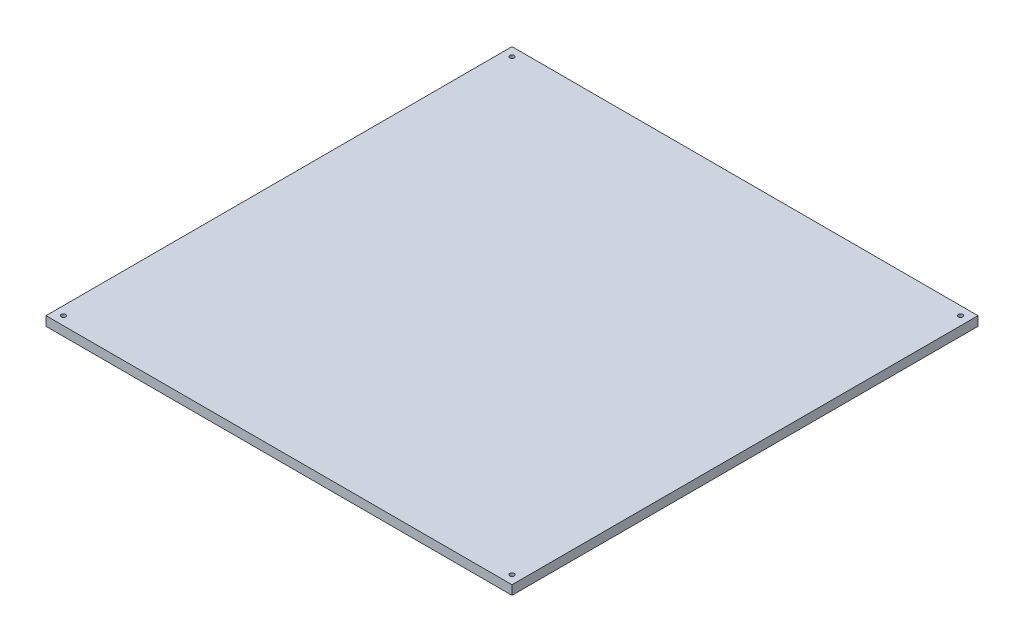
ISO-10303-21;
HEADER;
FILE_DESCRIPTION(('STEP AP214'),'2;1');
FILE_NAME('part.step','',(''),(''),'','','');
FILE_SCHEMA(('AUTOMOTIVE_DESIGN { 1 0 10303 214 1 1 1 1 }'));
ENDSEC;
DATA;
#1=APPLICATION_CONTEXT('core data for automotive mechanical design processes');
#2=APPLICATION_PROTOCOL_DEFINITION('international standard','automotive_design',2000,#1);
#3=PRODUCT_CONTEXT('',#1,'mechanical');
#4=PRODUCT('Part','Part','',(#3));
#5=PRODUCT_RELATED_PRODUCT_CATEGORY('part','',(#4));
#6=PRODUCT_DEFINITION_FORMATION('','',#4);
#7=PRODUCT_DEFINITION_CONTEXT('part definition',#1,'design');
#8=PRODUCT_DEFINITION('design','',#6,#7);
#9=PRODUCT_DEFINITION_SHAPE('','',#8);
#10=(LENGTH_UNIT() NAMED_UNIT(*) SI_UNIT(.MILLI.,.METRE.));
#11=(NAMED_UNIT(*) PLANE_ANGLE_UNIT() SI_UNIT($,.RADIAN.));
#12=(NAMED_UNIT(*) SI_UNIT($,.STERADIAN.) SOLID_ANGLE_UNIT());
#13=UNCERTAINTY_MEASURE_WITH_UNIT(LENGTH_MEASURE(1.E-05),#10,'distance_accuracy_value','');
#14=(GEOMETRIC_REPRESENTATION_CONTEXT(3) GLOBAL_UNCERTAINTY_ASSIGNED_CONTEXT((#13)) GLOBAL_UNIT_ASSIGNED_CONTEXT((#10,
#11,#12)) REPRESENTATION_CONTEXT('',''));
#15=CARTESIAN_POINT('',(0.,0.,0.));
#16=DIRECTION('',(0.,0.,1.));
#17=DIRECTION('',(1.,0.,0.));
#18=AXIS2_PLACEMENT_3D('',#15,#16,#17);
#19=CARTESIAN_POINT('',(-160.,-6.35,160.));
#20=DIRECTION('',(0.,0.,1.));
#21=DIRECTION('',(1.,0.,0.));
#22=AXIS2_PLACEMENT_3D('',#19,#20,#21);
#23=PLANE('',#22);
#24=DIRECTION('',(1.,0.,0.));
#25=VECTOR('',#24,1.);
#26=CARTESIAN_POINT('',(-160.,0.,160.));
#27=LINE('',#26,#25);
#28=CARTESIAN_POINT('',(-160.,0.,160.));
#29=VERTEX_POINT('',#28);
#30=CARTESIAN_POINT('',(160.,0.,160.));
#31=VERTEX_POINT('',#30);
#32=EDGE_CURVE('E105',#29,#31,#27,.T.);
#33=ORIENTED_EDGE('',*,*,#32,.F.);
#34=DIRECTION('',(0.,1.,0.));
#35=VECTOR('',#34,1.);
#36=CARTESIAN_POINT('',(-160.,-6.35,160.));
#37=LINE('',#36,#35);
#38=CARTESIAN_POINT('',(-160.,-6.35,160.));
#39=VERTEX_POINT('',#38);
#40=EDGE_CURVE('E11',#39,#29,#37,.T.);
#41=ORIENTED_EDGE('',*,*,#40,.F.);
#42=DIRECTION('',(1.,0.,0.));
#43=VECTOR('',#42,1.);
#44=CARTESIAN_POINT('',(-160.,-6.35,160.));
#45=LINE('',#44,#43);
#46=CARTESIAN_POINT('',(160.,-6.35,160.));
#47=VERTEX_POINT('',#46);
#48=EDGE_CURVE('E96',#39,#47,#45,.T.);
#49=ORIENTED_EDGE('',*,*,#48,.T.);
#50=DIRECTION('',(0.,1.,0.));
#51=VECTOR('',#50,1.);
#52=CARTESIAN_POINT('',(160.,-6.35,160.));
#53=LINE('',#52,#51);
#54=EDGE_CURVE('E40',#47,#31,#53,.T.);
#55=ORIENTED_EDGE('',*,*,#54,.T.);
#56=EDGE_LOOP('',(#33,#41,#49,#55));
#57=FACE_BOUND('',#56,.T.);
#58=ADVANCED_FACE('F37',(#57),#23,.T.);
#59=CARTESIAN_POINT('',(-160.,-6.35,-160.));
#60=DIRECTION('',(-1.,0.,0.));
#61=DIRECTION('',(0.,0.,1.));
#62=AXIS2_PLACEMENT_3D('',#59,#60,#61);
#63=PLANE('',#62);
#64=DIRECTION('',(0.,0.,1.));
#65=VECTOR('',#64,1.);
#66=CARTESIAN_POINT('',(-160.,0.,-160.));
#67=LINE('',#66,#65);
#68=CARTESIAN_POINT('',(-160.,0.,-160.));
#69=VERTEX_POINT('',#68);
#70=EDGE_CURVE('E100',#69,#29,#67,.T.);
#71=ORIENTED_EDGE('',*,*,#70,.F.);
#72=DIRECTION('',(0.,1.,0.));
#73=VECTOR('',#72,1.);
#74=CARTESIAN_POINT('',(-160.,-6.35,-160.));
#75=LINE('',#74,#73);
#76=CARTESIAN_POINT('',(-160.,-6.35,-160.));
#77=VERTEX_POINT('',#76);
#78=EDGE_CURVE('E46',#77,#69,#75,.T.);
#79=ORIENTED_EDGE('',*,*,#78,.F.);
#80=DIRECTION('',(0.,0.,1.));
#81=VECTOR('',#80,1.);
#82=CARTESIAN_POINT('',(-160.,-6.35,-160.));
#83=LINE('',#82,#81);
#84=EDGE_CURVE('E92',#77,#39,#83,.T.);
#85=ORIENTED_EDGE('',*,*,#84,.T.);
#86=ORIENTED_EDGE('',*,*,#40,.T.);
#87=EDGE_LOOP('',(#71,#79,#85,#86));
#88=FACE_BOUND('',#87,.T.);
#89=ADVANCED_FACE('F117',(#88),#63,.T.);
#90=CARTESIAN_POINT('',(160.,-6.35,-160.));
#91=DIRECTION('',(0.,0.,-1.));
#92=DIRECTION('',(-1.,0.,0.));
#93=AXIS2_PLACEMENT_3D('',#90,#91,#92);
#94=PLANE('',#93);
#95=DIRECTION('',(-1.,0.,0.));
#96=VECTOR('',#95,1.);
#97=CARTESIAN_POINT('',(160.,0.,-160.));
#98=LINE('',#97,#96);
#99=CARTESIAN_POINT('',(160.,0.,-160.));
#100=VERTEX_POINT('',#99);
#101=EDGE_CURVE('E87',#100,#69,#98,.T.);
#102=ORIENTED_EDGE('',*,*,#101,.F.);
#103=DIRECTION('',(0.,1.,0.));
#104=VECTOR('',#103,1.);
#105=CARTESIAN_POINT('',(160.,-6.35,-160.));
#106=LINE('',#105,#104);
#107=CARTESIAN_POINT('',(160.,-6.35,-160.));
#108=VERTEX_POINT('',#107);
#109=EDGE_CURVE('E82',#108,#100,#106,.T.);
#110=ORIENTED_EDGE('',*,*,#109,.F.);
#111=DIRECTION('',(-1.,0.,0.));
#112=VECTOR('',#111,1.);
#113=CARTESIAN_POINT('',(160.,-6.35,-160.));
#114=LINE('',#113,#112);
#115=EDGE_CURVE('E85',#108,#77,#114,.T.);
#116=ORIENTED_EDGE('',*,*,#115,.T.);
#117=ORIENTED_EDGE('',*,*,#78,.T.);
#118=EDGE_LOOP('',(#102,#110,#116,#117));
#119=FACE_BOUND('',#118,.T.);
#120=ADVANCED_FACE('F84',(#119),#94,.T.);
#121=CARTESIAN_POINT('',(160.,-6.35,160.));
#122=DIRECTION('',(1.,0.,0.));
#123=DIRECTION('',(0.,0.,-1.));
#124=AXIS2_PLACEMENT_3D('',#121,#122,#123);
#125=PLANE('',#124);
#126=DIRECTION('',(0.,0.,-1.));
#127=VECTOR('',#126,1.);
#128=CARTESIAN_POINT('',(160.,0.,160.));
#129=LINE('',#128,#127);
#130=EDGE_CURVE('E108',#31,#100,#129,.T.);
#131=ORIENTED_EDGE('',*,*,#130,.F.);
#132=ORIENTED_EDGE('',*,*,#54,.F.);
#133=DIRECTION('',(0.,0.,-1.));
#134=VECTOR('',#133,1.);
#135=CARTESIAN_POINT('',(160.,-6.35,160.));
#136=LINE('',#135,#134);
#137=EDGE_CURVE('E91',#47,#108,#136,.T.);
#138=ORIENTED_EDGE('',*,*,#137,.T.);
#139=ORIENTED_EDGE('',*,*,#109,.T.);
#140=EDGE_LOOP('',(#131,#132,#138,#139));
#141=FACE_BOUND('',#140,.T.);
#142=ADVANCED_FACE('F94',(#141),#125,.T.);
#143=CARTESIAN_POINT('',(0.,-6.35,0.));
#144=DIRECTION('',(0.,1.,0.));
#145=DIRECTION('',(0.,0.,1.));
#146=AXIS2_PLACEMENT_3D('',#143,#144,#145);
#147=PLANE('',#146);
#148=CARTESIAN_POINT('',(-154.,-6.35,-154.));
#149=DIRECTION('',(0.,1.,0.));
#150=DIRECTION('',(0.,0.,-1.));
#151=AXIS2_PLACEMENT_3D('',#148,#149,#150);
#152=CIRCLE('',#151,1.54999999999999);
#153=CARTESIAN_POINT('',(-154.,-6.35,-155.55));
#154=VERTEX_POINT('',#153);
#155=EDGE_CURVE('E157',#154,#154,#152,.T.);
#156=ORIENTED_EDGE('',*,*,#155,.T.);
#157=EDGE_LOOP('',(#156));
#158=FACE_BOUND('',#157,.T.);
#159=CARTESIAN_POINT('',(154.,-6.35,154.));
#160=DIRECTION('',(0.,1.,0.));
#161=DIRECTION('',(0.,0.,-1.));
#162=AXIS2_PLACEMENT_3D('',#159,#160,#161);
#163=CIRCLE('',#162,1.54999999999999);
#164=CARTESIAN_POINT('',(154.,-6.35,152.45));
#165=VERTEX_POINT('',#164);
#166=EDGE_CURVE('E165',#165,#165,#163,.T.);
#167=ORIENTED_EDGE('',*,*,#166,.T.);
#168=EDGE_LOOP('',(#167));
#169=FACE_BOUND('',#168,.T.);
#170=CARTESIAN_POINT('',(-154.,-6.35,154.));
#171=DIRECTION('',(0.,1.,0.));
#172=DIRECTION('',(0.,0.,-1.));
#173=AXIS2_PLACEMENT_3D('',#170,#171,#172);
#174=CIRCLE('',#173,1.54999999999999);
#175=CARTESIAN_POINT('',(-154.,-6.35,152.45));
#176=VERTEX_POINT('',#175);
#177=EDGE_CURVE('E171',#176,#176,#174,.T.);
#178=ORIENTED_EDGE('',*,*,#177,.T.);
#179=EDGE_LOOP('',(#178));
#180=FACE_BOUND('',#179,.T.);
#181=CARTESIAN_POINT('',(154.,-6.35,-154.));
#182=DIRECTION('',(0.,1.,0.));
#183=DIRECTION('',(0.,0.,-1.));
#184=AXIS2_PLACEMENT_3D('',#181,#182,#183);
#185=CIRCLE('',#184,1.54999999999999);
#186=CARTESIAN_POINT('',(154.,-6.35,-155.55));
#187=VERTEX_POINT('',#186);
#188=EDGE_CURVE('E109',#187,#187,#185,.T.);
#189=ORIENTED_EDGE('',*,*,#188,.T.);
#190=EDGE_LOOP('',(#189));
#191=FACE_BOUND('',#190,.T.);
#192=ORIENTED_EDGE('',*,*,#48,.F.);
#193=ORIENTED_EDGE('',*,*,#84,.F.);
#194=ORIENTED_EDGE('',*,*,#115,.F.);
#195=ORIENTED_EDGE('',*,*,#137,.F.);
#196=EDGE_LOOP('',(#192,#193,#194,#195));
#197=FACE_BOUND('',#196,.T.);
#198=ADVANCED_FACE('F90',(#158,#169,#180,#191,#197),#147,.F.);
#199=CARTESIAN_POINT('',(0.,0.,0.));
#200=DIRECTION('',(0.,1.,0.));
#201=DIRECTION('',(0.,0.,1.));
#202=AXIS2_PLACEMENT_3D('',#199,#200,#201);
#203=PLANE('',#202);
#204=CARTESIAN_POINT('',(-154.,0.,-154.));
#205=DIRECTION('',(0.,1.,0.));
#206=DIRECTION('',(0.,0.,-1.));
#207=AXIS2_PLACEMENT_3D('',#204,#205,#206);
#208=CIRCLE('',#207,1.54999999999999);
#209=CARTESIAN_POINT('',(-154.,0.,-155.55));
#210=VERTEX_POINT('',#209);
#211=EDGE_CURVE('E160',#210,#210,#208,.T.);
#212=ORIENTED_EDGE('',*,*,#211,.F.);
#213=EDGE_LOOP('',(#212));
#214=FACE_BOUND('',#213,.T.);
#215=CARTESIAN_POINT('',(154.,0.,154.));
#216=DIRECTION('',(0.,1.,0.));
#217=DIRECTION('',(0.,0.,-1.));
#218=AXIS2_PLACEMENT_3D('',#215,#216,#217);
#219=CIRCLE('',#218,1.54999999999999);
#220=CARTESIAN_POINT('',(154.,0.,152.45));
#221=VERTEX_POINT('',#220);
#222=EDGE_CURVE('E162',#221,#221,#219,.T.);
#223=ORIENTED_EDGE('',*,*,#222,.F.);
#224=EDGE_LOOP('',(#223));
#225=FACE_BOUND('',#224,.T.);
#226=CARTESIAN_POINT('',(-154.,0.,154.));
#227=DIRECTION('',(0.,1.,0.));
#228=DIRECTION('',(0.,0.,-1.));
#229=AXIS2_PLACEMENT_3D('',#226,#227,#228);
#230=CIRCLE('',#229,1.54999999999999);
#231=CARTESIAN_POINT('',(-154.,0.,152.45));
#232=VERTEX_POINT('',#231);
#233=EDGE_CURVE('E168',#232,#232,#230,.T.);
#234=ORIENTED_EDGE('',*,*,#233,.F.);
#235=EDGE_LOOP('',(#234));
#236=FACE_BOUND('',#235,.T.);
#237=CARTESIAN_POINT('',(154.,0.,-154.));
#238=DIRECTION('',(0.,1.,0.));
#239=DIRECTION('',(0.,0.,-1.));
#240=AXIS2_PLACEMENT_3D('',#237,#238,#239);
#241=CIRCLE('',#240,1.54999999999999);
#242=CARTESIAN_POINT('',(154.,0.,-155.55));
#243=VERTEX_POINT('',#242);
#244=EDGE_CURVE('E174',#243,#243,#241,.T.);
#245=ORIENTED_EDGE('',*,*,#244,.F.);
#246=EDGE_LOOP('',(#245));
#247=FACE_BOUND('',#246,.T.);
#248=ORIENTED_EDGE('',*,*,#32,.T.);
#249=ORIENTED_EDGE('',*,*,#130,.T.);
#250=ORIENTED_EDGE('',*,*,#101,.T.);
#251=ORIENTED_EDGE('',*,*,#70,.T.);
#252=EDGE_LOOP('',(#248,#249,#250,#251));
#253=FACE_BOUND('',#252,.T.);
#254=ADVANCED_FACE('F116',(#214,#225,#236,#247,#253),#203,.T.);
#255=CARTESIAN_POINT('',(154.,-6.35,-154.));
#256=DIRECTION('',(0.,1.,0.));
#257=DIRECTION('',(0.,0.,1.));
#258=AXIS2_PLACEMENT_3D('',#255,#256,#257);
#259=CYLINDRICAL_SURFACE('',#258,1.54999999999999);
#260=ORIENTED_EDGE('',*,*,#188,.F.);
#261=EDGE_LOOP('',(#260));
#262=FACE_BOUND('',#261,.T.);
#263=ORIENTED_EDGE('',*,*,#244,.T.);
#264=EDGE_LOOP('',(#263));
#265=FACE_BOUND('',#264,.T.);
#266=ADVANCED_FACE('F134',(#262,#265),#259,.F.);
#267=CARTESIAN_POINT('',(-154.,-6.35,154.));
#268=DIRECTION('',(0.,1.,0.));
#269=DIRECTION('',(0.,0.,1.));
#270=AXIS2_PLACEMENT_3D('',#267,#268,#269);
#271=CYLINDRICAL_SURFACE('',#270,1.54999999999999);
#272=ORIENTED_EDGE('',*,*,#177,.F.);
#273=EDGE_LOOP('',(#272));
#274=FACE_BOUND('',#273,.T.);
#275=ORIENTED_EDGE('',*,*,#233,.T.);
#276=EDGE_LOOP('',(#275));
#277=FACE_BOUND('',#276,.T.);
#278=ADVANCED_FACE('F141',(#274,#277),#271,.F.);
#279=CARTESIAN_POINT('',(154.,-6.35,154.));
#280=DIRECTION('',(0.,1.,0.));
#281=DIRECTION('',(0.,0.,1.));
#282=AXIS2_PLACEMENT_3D('',#279,#280,#281);
#283=CYLINDRICAL_SURFACE('',#282,1.54999999999999);
#284=ORIENTED_EDGE('',*,*,#166,.F.);
#285=EDGE_LOOP('',(#284));
#286=FACE_BOUND('',#285,.T.);
#287=ORIENTED_EDGE('',*,*,#222,.T.);
#288=EDGE_LOOP('',(#287));
#289=FACE_BOUND('',#288,.T.);
#290=ADVANCED_FACE('F145',(#286,#289),#283,.F.);
#291=CARTESIAN_POINT('',(-154.,-6.35,-154.));
#292=DIRECTION('',(0.,1.,0.));
#293=DIRECTION('',(0.,0.,1.));
#294=AXIS2_PLACEMENT_3D('',#291,#292,#293);
#295=CYLINDRICAL_SURFACE('',#294,1.54999999999999);
#296=ORIENTED_EDGE('',*,*,#155,.F.);
#297=EDGE_LOOP('',(#296));
#298=FACE_BOUND('',#297,.T.);
#299=ORIENTED_EDGE('',*,*,#211,.T.);
#300=EDGE_LOOP('',(#299));
#301=FACE_BOUND('',#300,.T.);
#302=ADVANCED_FACE('F149',(#298,#301),#295,.F.);
#303=CLOSED_SHELL('',(#58,#89,#120,#142,#198,#254,#266,#278,#290,#302));
#304=MANIFOLD_SOLID_BREP('B2',#303);
#305=ADVANCED_BREP_SHAPE_REPRESENTATION('',(#18,#304),#14);
#306=SHAPE_DEFINITION_REPRESENTATION(#9,#305);
ENDSEC;
END-ISO-10303-21;
